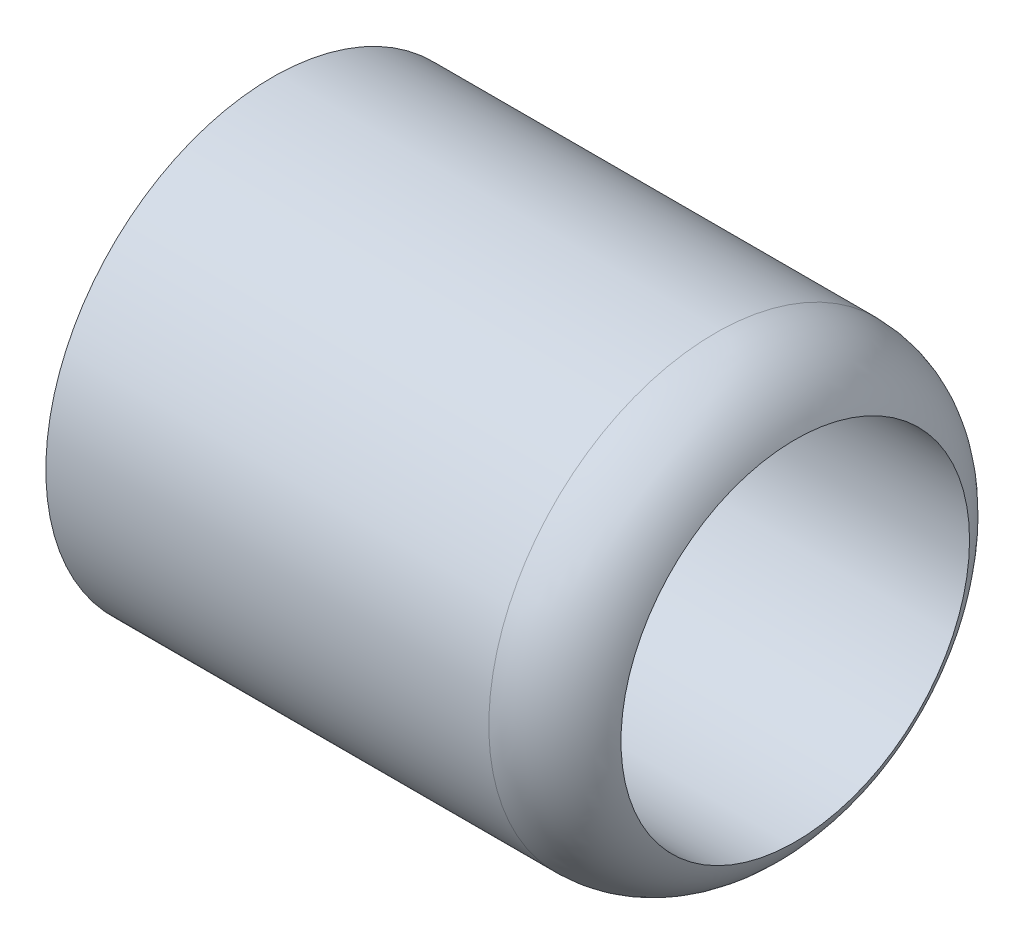
ISO-10303-21;
HEADER;
FILE_DESCRIPTION(('STEP AP214'),'2;1');
FILE_NAME('part.step','',(''),(''),'','','');
FILE_SCHEMA(('AUTOMOTIVE_DESIGN { 1 0 10303 214 1 1 1 1 }'));
ENDSEC;
DATA;
#1=APPLICATION_CONTEXT('core data for automotive mechanical design processes');
#2=APPLICATION_PROTOCOL_DEFINITION('international standard','automotive_design',2000,#1);
#3=PRODUCT_CONTEXT('',#1,'mechanical');
#4=PRODUCT('Part','Part','',(#3));
#5=PRODUCT_RELATED_PRODUCT_CATEGORY('part','',(#4));
#6=PRODUCT_DEFINITION_FORMATION('','',#4);
#7=PRODUCT_DEFINITION_CONTEXT('part definition',#1,'design');
#8=PRODUCT_DEFINITION('design','',#6,#7);
#9=PRODUCT_DEFINITION_SHAPE('','',#8);
#10=(LENGTH_UNIT() NAMED_UNIT(*) SI_UNIT(.MILLI.,.METRE.));
#11=(NAMED_UNIT(*) PLANE_ANGLE_UNIT() SI_UNIT($,.RADIAN.));
#12=(NAMED_UNIT(*) SI_UNIT($,.STERADIAN.) SOLID_ANGLE_UNIT());
#13=UNCERTAINTY_MEASURE_WITH_UNIT(LENGTH_MEASURE(1.E-05),#10,'distance_accuracy_value','');
#14=(GEOMETRIC_REPRESENTATION_CONTEXT(3) GLOBAL_UNCERTAINTY_ASSIGNED_CONTEXT((#13)) GLOBAL_UNIT_ASSIGNED_CONTEXT((#10,
#11,#12)) REPRESENTATION_CONTEXT('',''));
#15=CARTESIAN_POINT('',(0.,0.,0.));
#16=DIRECTION('',(0.,0.,1.));
#17=DIRECTION('',(1.,0.,0.));
#18=AXIS2_PLACEMENT_3D('',#15,#16,#17);
#19=CARTESIAN_POINT('',(0.,3.81,0.));
#20=DIRECTION('',(1.,0.,0.));
#21=DIRECTION('',(0.,0.,1.));
#22=AXIS2_PLACEMENT_3D('',#19,#20,#21);
#23=PLANE('',#22);
#24=CARTESIAN_POINT('',(0.,-12.7,0.));
#25=DIRECTION('',(-1.,0.,0.));
#26=DIRECTION('',(0.,0.,1.));
#27=AXIS2_PLACEMENT_3D('',#24,#25,#26);
#28=CIRCLE('',#27,14.224);
#29=CARTESIAN_POINT('',(0.,-12.7,14.224));
#30=VERTEX_POINT('',#29);
#31=EDGE_CURVE('E10',#30,#30,#28,.T.);
#32=ORIENTED_EDGE('',*,*,#31,.F.);
#33=EDGE_LOOP('',(#32));
#34=FACE_BOUND('',#33,.T.);
#35=CARTESIAN_POINT('',(0.,-12.7,0.));
#36=DIRECTION('',(1.,0.,0.));
#37=DIRECTION('',(0.,0.,-1.));
#38=AXIS2_PLACEMENT_3D('',#35,#36,#37);
#39=CIRCLE('',#38,16.51);
#40=CARTESIAN_POINT('',(0.,-12.7,-16.51));
#41=VERTEX_POINT('',#40);
#42=EDGE_CURVE('E43',#41,#41,#39,.T.);
#43=ORIENTED_EDGE('',*,*,#42,.F.);
#44=EDGE_LOOP('',(#43));
#45=FACE_BOUND('',#44,.T.);
#46=ADVANCED_FACE('F32',(#34,#45),#23,.F.);
#47=CARTESIAN_POINT('',(-29.8189598133346,-12.7,0.));
#48=DIRECTION('',(-1.,0.,0.));
#49=DIRECTION('',(0.,0.,-1.));
#50=AXIS2_PLACEMENT_3D('',#47,#48,#49);
#51=CYLINDRICAL_SURFACE('',#50,16.51);
#52=ORIENTED_EDGE('',*,*,#42,.T.);
#53=EDGE_LOOP('',(#52));
#54=FACE_BOUND('',#53,.T.);
#55=CARTESIAN_POINT('',(32.2801288674061,-12.7,0.));
#56=DIRECTION('',(1.,0.,0.));
#57=DIRECTION('',(0.,0.,-1.));
#58=AXIS2_PLACEMENT_3D('',#55,#56,#57);
#59=CIRCLE('',#58,16.51);
#60=CARTESIAN_POINT('',(32.2801288674061,-12.7,-16.51));
#61=VERTEX_POINT('',#60);
#62=EDGE_CURVE('E47',#61,#61,#59,.T.);
#63=ORIENTED_EDGE('',*,*,#62,.F.);
#64=EDGE_LOOP('',(#63));
#65=FACE_BOUND('',#64,.T.);
#66=ADVANCED_FACE('F85',(#54,#65),#51,.T.);
#67=CARTESIAN_POINT('',(32.2801288674061,-12.7,0.));
#68=DIRECTION('',(-1.,0.,0.));
#69=DIRECTION('',(0.,0.,-1.));
#70=AXIS2_PLACEMENT_3D('',#67,#68,#69);
#71=TOROIDAL_SURFACE('',#70,10.16,6.35);
#72=ORIENTED_EDGE('',*,*,#62,.T.);
#73=EDGE_LOOP('',(#72));
#74=FACE_BOUND('',#73,.T.);
#75=CARTESIAN_POINT('',(38.1,-12.7,0.));
#76=DIRECTION('',(1.,0.,0.));
#77=DIRECTION('',(0.,0.,-1.));
#78=AXIS2_PLACEMENT_3D('',#75,#76,#77);
#79=CIRCLE('',#78,12.7);
#80=CARTESIAN_POINT('',(38.1,-12.7,-12.7));
#81=VERTEX_POINT('',#80);
#82=EDGE_CURVE('E52',#81,#81,#79,.T.);
#83=ORIENTED_EDGE('',*,*,#82,.F.);
#84=EDGE_LOOP('',(#83));
#85=FACE_BOUND('',#84,.T.);
#86=ADVANCED_FACE('F90',(#74,#85),#71,.T.);
#87=CARTESIAN_POINT('',(-29.8189598133346,-12.7,0.));
#88=DIRECTION('',(-1.,0.,0.));
#89=DIRECTION('',(0.,0.,-1.));
#90=AXIS2_PLACEMENT_3D('',#87,#88,#89);
#91=CYLINDRICAL_SURFACE('',#90,12.7);
#92=ORIENTED_EDGE('',*,*,#82,.T.);
#93=EDGE_LOOP('',(#92));
#94=FACE_BOUND('',#93,.T.);
#95=CARTESIAN_POINT('',(19.05,-12.7,0.));
#96=DIRECTION('',(1.,0.,0.));
#97=DIRECTION('',(0.,0.,-1.));
#98=AXIS2_PLACEMENT_3D('',#95,#96,#97);
#99=CIRCLE('',#98,12.7);
#100=CARTESIAN_POINT('',(19.05,-12.7,-12.7));
#101=VERTEX_POINT('',#100);
#102=EDGE_CURVE('E55',#101,#101,#99,.T.);
#103=ORIENTED_EDGE('',*,*,#102,.F.);
#104=EDGE_LOOP('',(#103));
#105=FACE_BOUND('',#104,.T.);
#106=ADVANCED_FACE('F97',(#94,#105),#91,.F.);
#107=CARTESIAN_POINT('',(19.05,0.,0.));
#108=DIRECTION('',(-1.,0.,0.));
#109=DIRECTION('',(0.,0.,-1.));
#110=AXIS2_PLACEMENT_3D('',#107,#108,#109);
#111=PLANE('',#110);
#112=ORIENTED_EDGE('',*,*,#102,.T.);
#113=EDGE_LOOP('',(#112));
#114=FACE_BOUND('',#113,.T.);
#115=CARTESIAN_POINT('',(19.05,-12.7,0.));
#116=DIRECTION('',(1.,0.,0.));
#117=DIRECTION('',(0.,0.,-1.));
#118=AXIS2_PLACEMENT_3D('',#115,#116,#117);
#119=CIRCLE('',#118,8.128);
#120=CARTESIAN_POINT('',(19.05,-12.7,-8.128));
#121=VERTEX_POINT('',#120);
#122=EDGE_CURVE('E58',#121,#121,#119,.T.);
#123=ORIENTED_EDGE('',*,*,#122,.F.);
#124=EDGE_LOOP('',(#123));
#125=FACE_BOUND('',#124,.T.);
#126=ADVANCED_FACE('F81',(#114,#125),#111,.F.);
#127=CARTESIAN_POINT('',(-29.8189598133346,-12.7,0.));
#128=DIRECTION('',(-1.,0.,0.));
#129=DIRECTION('',(0.,0.,-1.));
#130=AXIS2_PLACEMENT_3D('',#127,#128,#129);
#131=CYLINDRICAL_SURFACE('',#130,8.128);
#132=ORIENTED_EDGE('',*,*,#122,.T.);
#133=EDGE_LOOP('',(#132));
#134=FACE_BOUND('',#133,.T.);
#135=CARTESIAN_POINT('',(12.7,-12.7,0.));
#136=DIRECTION('',(1.,0.,0.));
#137=DIRECTION('',(0.,0.,-1.));
#138=AXIS2_PLACEMENT_3D('',#135,#136,#137);
#139=CIRCLE('',#138,8.128);
#140=CARTESIAN_POINT('',(12.7,-12.7,-8.128));
#141=VERTEX_POINT('',#140);
#142=EDGE_CURVE('E61',#141,#141,#139,.T.);
#143=ORIENTED_EDGE('',*,*,#142,.F.);
#144=EDGE_LOOP('',(#143));
#145=FACE_BOUND('',#144,.T.);
#146=ADVANCED_FACE('F72',(#134,#145),#131,.F.);
#147=CARTESIAN_POINT('',(12.7,-4.572,0.));
#148=DIRECTION('',(1.,0.,0.));
#149=DIRECTION('',(0.,0.,1.));
#150=AXIS2_PLACEMENT_3D('',#147,#148,#149);
#151=PLANE('',#150);
#152=ORIENTED_EDGE('',*,*,#142,.T.);
#153=EDGE_LOOP('',(#152));
#154=FACE_BOUND('',#153,.T.);
#155=CARTESIAN_POINT('',(12.7,-12.7,0.));
#156=DIRECTION('',(1.,0.,0.));
#157=DIRECTION('',(0.,0.,-1.));
#158=AXIS2_PLACEMENT_3D('',#155,#156,#157);
#159=CIRCLE('',#158,12.7);
#160=CARTESIAN_POINT('',(12.7,-12.7,-12.7));
#161=VERTEX_POINT('',#160);
#162=EDGE_CURVE('E64',#161,#161,#159,.T.);
#163=ORIENTED_EDGE('',*,*,#162,.F.);
#164=EDGE_LOOP('',(#163));
#165=FACE_BOUND('',#164,.T.);
#166=ADVANCED_FACE('F70',(#154,#165),#151,.F.);
#167=CARTESIAN_POINT('',(-29.8189598133346,-12.7,0.));
#168=DIRECTION('',(-1.,0.,0.));
#169=DIRECTION('',(0.,0.,-1.));
#170=AXIS2_PLACEMENT_3D('',#167,#168,#169);
#171=CYLINDRICAL_SURFACE('',#170,12.7);
#172=CARTESIAN_POINT('',(1.524,-12.7,0.));
#173=DIRECTION('',(-1.,0.,0.));
#174=DIRECTION('',(0.,0.,1.));
#175=AXIS2_PLACEMENT_3D('',#172,#173,#174);
#176=CIRCLE('',#175,12.7);
#177=CARTESIAN_POINT('',(1.524,-12.7,12.7));
#178=VERTEX_POINT('',#177);
#179=EDGE_CURVE('E39',#178,#178,#176,.F.);
#180=ORIENTED_EDGE('',*,*,#179,.F.);
#181=EDGE_LOOP('',(#180));
#182=FACE_BOUND('',#181,.T.);
#183=ORIENTED_EDGE('',*,*,#162,.T.);
#184=EDGE_LOOP('',(#183));
#185=FACE_BOUND('',#184,.T.);
#186=ADVANCED_FACE('F68',(#182,#185),#171,.F.);
#187=CARTESIAN_POINT('',(1.524,-12.7,0.));
#188=DIRECTION('',(-1.,0.,0.));
#189=DIRECTION('',(0.,0.,-1.));
#190=AXIS2_PLACEMENT_3D('',#187,#188,#189);
#191=CONICAL_SURFACE('',#190,12.7,0.785398163397448);
#192=ORIENTED_EDGE('',*,*,#31,.T.);
#193=EDGE_LOOP('',(#192));
#194=FACE_BOUND('',#193,.T.);
#195=ORIENTED_EDGE('',*,*,#179,.T.);
#196=EDGE_LOOP('',(#195));
#197=FACE_BOUND('',#196,.T.);
#198=ADVANCED_FACE('F34',(#194,#197),#191,.F.);
#199=CLOSED_SHELL('',(#46,#66,#86,#106,#126,#146,#166,#186,#198));
#200=MANIFOLD_SOLID_BREP('B2',#199);
#201=ADVANCED_BREP_SHAPE_REPRESENTATION('',(#18,#200),#14);
#202=SHAPE_DEFINITION_REPRESENTATION(#9,#201);
ENDSEC;
END-ISO-10303-21;
